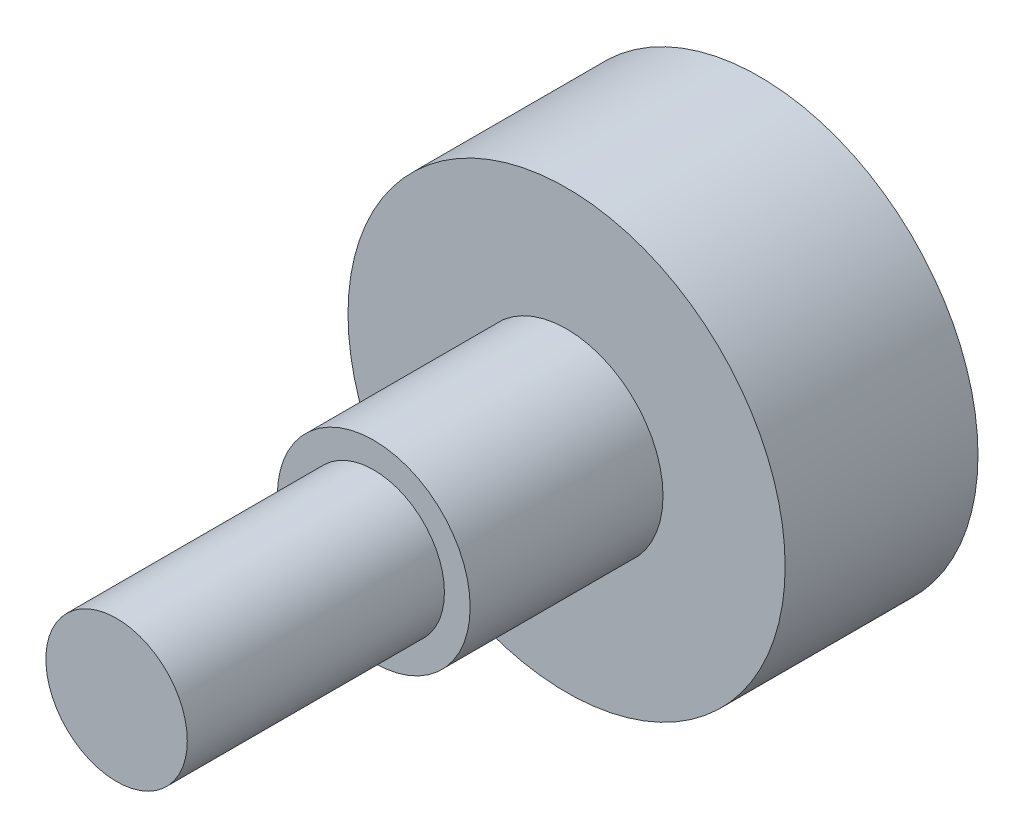
ISO-10303-21;
HEADER;
FILE_DESCRIPTION(('STEP AP214'),'2;1');
FILE_NAME('part.step','',(''),(''),'','','');
FILE_SCHEMA(('AUTOMOTIVE_DESIGN { 1 0 10303 214 1 1 1 1 }'));
ENDSEC;
DATA;
#1=APPLICATION_CONTEXT('core data for automotive mechanical design processes');
#2=APPLICATION_PROTOCOL_DEFINITION('international standard','automotive_design',2000,#1);
#3=PRODUCT_CONTEXT('',#1,'mechanical');
#4=PRODUCT('Part','Part','',(#3));
#5=PRODUCT_RELATED_PRODUCT_CATEGORY('part','',(#4));
#6=PRODUCT_DEFINITION_FORMATION('','',#4);
#7=PRODUCT_DEFINITION_CONTEXT('part definition',#1,'design');
#8=PRODUCT_DEFINITION('design','',#6,#7);
#9=PRODUCT_DEFINITION_SHAPE('','',#8);
#10=(LENGTH_UNIT() NAMED_UNIT(*) SI_UNIT(.MILLI.,.METRE.));
#11=(NAMED_UNIT(*) PLANE_ANGLE_UNIT() SI_UNIT($,.RADIAN.));
#12=(NAMED_UNIT(*) SI_UNIT($,.STERADIAN.) SOLID_ANGLE_UNIT());
#13=UNCERTAINTY_MEASURE_WITH_UNIT(LENGTH_MEASURE(1.E-05),#10,'distance_accuracy_value','');
#14=(GEOMETRIC_REPRESENTATION_CONTEXT(3) GLOBAL_UNCERTAINTY_ASSIGNED_CONTEXT((#13)) GLOBAL_UNIT_ASSIGNED_CONTEXT((#10,
#11,#12)) REPRESENTATION_CONTEXT('',''));
#15=CARTESIAN_POINT('',(0.,0.,0.));
#16=DIRECTION('',(0.,0.,1.));
#17=DIRECTION('',(1.,0.,0.));
#18=AXIS2_PLACEMENT_3D('',#15,#16,#17);
#19=CARTESIAN_POINT('',(0.,0.,7.5));
#20=DIRECTION('',(0.,0.,-1.));
#21=DIRECTION('',(-1.,0.,0.));
#22=AXIS2_PLACEMENT_3D('',#19,#20,#21);
#23=CYLINDRICAL_SURFACE('',#22,8.5);
#24=CARTESIAN_POINT('',(0.,0.,7.5));
#25=DIRECTION('',(0.,0.,1.));
#26=DIRECTION('',(1.,0.,0.));
#27=AXIS2_PLACEMENT_3D('',#24,#25,#26);
#28=CIRCLE('',#27,8.5);
#29=CARTESIAN_POINT('',(8.5,0.,7.5));
#30=VERTEX_POINT('',#29);
#31=EDGE_CURVE('E10',#30,#30,#28,.T.);
#32=ORIENTED_EDGE('',*,*,#31,.F.);
#33=EDGE_LOOP('',(#32));
#34=FACE_BOUND('',#33,.T.);
#35=CARTESIAN_POINT('',(0.,0.,0.));
#36=DIRECTION('',(0.,0.,1.));
#37=DIRECTION('',(1.,0.,0.));
#38=AXIS2_PLACEMENT_3D('',#35,#36,#37);
#39=CIRCLE('',#38,8.5);
#40=CARTESIAN_POINT('',(8.5,0.,0.));
#41=VERTEX_POINT('',#40);
#42=EDGE_CURVE('E34',#41,#41,#39,.T.);
#43=ORIENTED_EDGE('',*,*,#42,.T.);
#44=EDGE_LOOP('',(#43));
#45=FACE_BOUND('',#44,.T.);
#46=ADVANCED_FACE('F31',(#34,#45),#23,.T.);
#47=CARTESIAN_POINT('',(0.,0.,7.5));
#48=DIRECTION('',(0.,0.,1.));
#49=DIRECTION('',(1.,0.,0.));
#50=AXIS2_PLACEMENT_3D('',#47,#48,#49);
#51=PLANE('',#50);
#52=CARTESIAN_POINT('',(0.,0.,7.5));
#53=DIRECTION('',(0.,0.,1.));
#54=DIRECTION('',(1.,0.,0.));
#55=AXIS2_PLACEMENT_3D('',#52,#53,#54);
#56=CIRCLE('',#55,3.75);
#57=CARTESIAN_POINT('',(3.75,0.,7.5));
#58=VERTEX_POINT('',#57);
#59=EDGE_CURVE('E43',#58,#58,#56,.T.);
#60=ORIENTED_EDGE('',*,*,#59,.F.);
#61=EDGE_LOOP('',(#60));
#62=FACE_BOUND('',#61,.T.);
#63=ORIENTED_EDGE('',*,*,#31,.T.);
#64=EDGE_LOOP('',(#63));
#65=FACE_BOUND('',#64,.T.);
#66=ADVANCED_FACE('F76',(#62,#65),#51,.T.);
#67=CARTESIAN_POINT('',(0.,0.,0.));
#68=DIRECTION('',(0.,0.,1.));
#69=DIRECTION('',(1.,0.,0.));
#70=AXIS2_PLACEMENT_3D('',#67,#68,#69);
#71=PLANE('',#70);
#72=ORIENTED_EDGE('',*,*,#42,.F.);
#73=EDGE_LOOP('',(#72));
#74=FACE_BOUND('',#73,.T.);
#75=ADVANCED_FACE('F72',(#74),#71,.F.);
#76=CARTESIAN_POINT('',(0.,0.,15.));
#77=DIRECTION('',(0.,0.,-1.));
#78=DIRECTION('',(-1.,0.,0.));
#79=AXIS2_PLACEMENT_3D('',#76,#77,#78);
#80=CYLINDRICAL_SURFACE('',#79,3.75);
#81=CARTESIAN_POINT('',(0.,0.,15.));
#82=DIRECTION('',(0.,0.,1.));
#83=DIRECTION('',(1.,0.,0.));
#84=AXIS2_PLACEMENT_3D('',#81,#82,#83);
#85=CIRCLE('',#84,3.75);
#86=CARTESIAN_POINT('',(3.75,0.,15.));
#87=VERTEX_POINT('',#86);
#88=EDGE_CURVE('E41',#87,#87,#85,.T.);
#89=ORIENTED_EDGE('',*,*,#88,.F.);
#90=EDGE_LOOP('',(#89));
#91=FACE_BOUND('',#90,.T.);
#92=ORIENTED_EDGE('',*,*,#59,.T.);
#93=EDGE_LOOP('',(#92));
#94=FACE_BOUND('',#93,.T.);
#95=ADVANCED_FACE('F66',(#91,#94),#80,.T.);
#96=CARTESIAN_POINT('',(0.,0.,15.));
#97=DIRECTION('',(0.,0.,1.));
#98=DIRECTION('',(1.,0.,0.));
#99=AXIS2_PLACEMENT_3D('',#96,#97,#98);
#100=PLANE('',#99);
#101=CARTESIAN_POINT('',(0.,0.,15.));
#102=DIRECTION('',(0.,0.,1.));
#103=DIRECTION('',(1.,0.,0.));
#104=AXIS2_PLACEMENT_3D('',#101,#102,#103);
#105=CIRCLE('',#104,2.75);
#106=CARTESIAN_POINT('',(2.75,0.,15.));
#107=VERTEX_POINT('',#106);
#108=EDGE_CURVE('E49',#107,#107,#105,.T.);
#109=ORIENTED_EDGE('',*,*,#108,.F.);
#110=EDGE_LOOP('',(#109));
#111=FACE_BOUND('',#110,.T.);
#112=ORIENTED_EDGE('',*,*,#88,.T.);
#113=EDGE_LOOP('',(#112));
#114=FACE_BOUND('',#113,.T.);
#115=ADVANCED_FACE('F60',(#111,#114),#100,.T.);
#116=CARTESIAN_POINT('',(0.,0.,25.));
#117=DIRECTION('',(0.,0.,-1.));
#118=DIRECTION('',(-1.,0.,0.));
#119=AXIS2_PLACEMENT_3D('',#116,#117,#118);
#120=CYLINDRICAL_SURFACE('',#119,2.75);
#121=CARTESIAN_POINT('',(0.,0.,25.));
#122=DIRECTION('',(0.,0.,1.));
#123=DIRECTION('',(1.,0.,0.));
#124=AXIS2_PLACEMENT_3D('',#121,#122,#123);
#125=CIRCLE('',#124,2.75);
#126=CARTESIAN_POINT('',(2.75,0.,25.));
#127=VERTEX_POINT('',#126);
#128=EDGE_CURVE('E46',#127,#127,#125,.T.);
#129=ORIENTED_EDGE('',*,*,#128,.F.);
#130=EDGE_LOOP('',(#129));
#131=FACE_BOUND('',#130,.T.);
#132=ORIENTED_EDGE('',*,*,#108,.T.);
#133=EDGE_LOOP('',(#132));
#134=FACE_BOUND('',#133,.T.);
#135=ADVANCED_FACE('F57',(#131,#134),#120,.T.);
#136=CARTESIAN_POINT('',(0.,0.,25.));
#137=DIRECTION('',(0.,0.,1.));
#138=DIRECTION('',(1.,0.,0.));
#139=AXIS2_PLACEMENT_3D('',#136,#137,#138);
#140=PLANE('',#139);
#141=ORIENTED_EDGE('',*,*,#128,.T.);
#142=EDGE_LOOP('',(#141));
#143=FACE_BOUND('',#142,.T.);
#144=ADVANCED_FACE('F55',(#143),#140,.T.);
#145=CLOSED_SHELL('',(#46,#66,#75,#95,#115,#135,#144));
#146=MANIFOLD_SOLID_BREP('B2',#145);
#147=ADVANCED_BREP_SHAPE_REPRESENTATION('',(#18,#146),#14);
#148=SHAPE_DEFINITION_REPRESENTATION(#9,#147);
ENDSEC;
END-ISO-10303-21;
